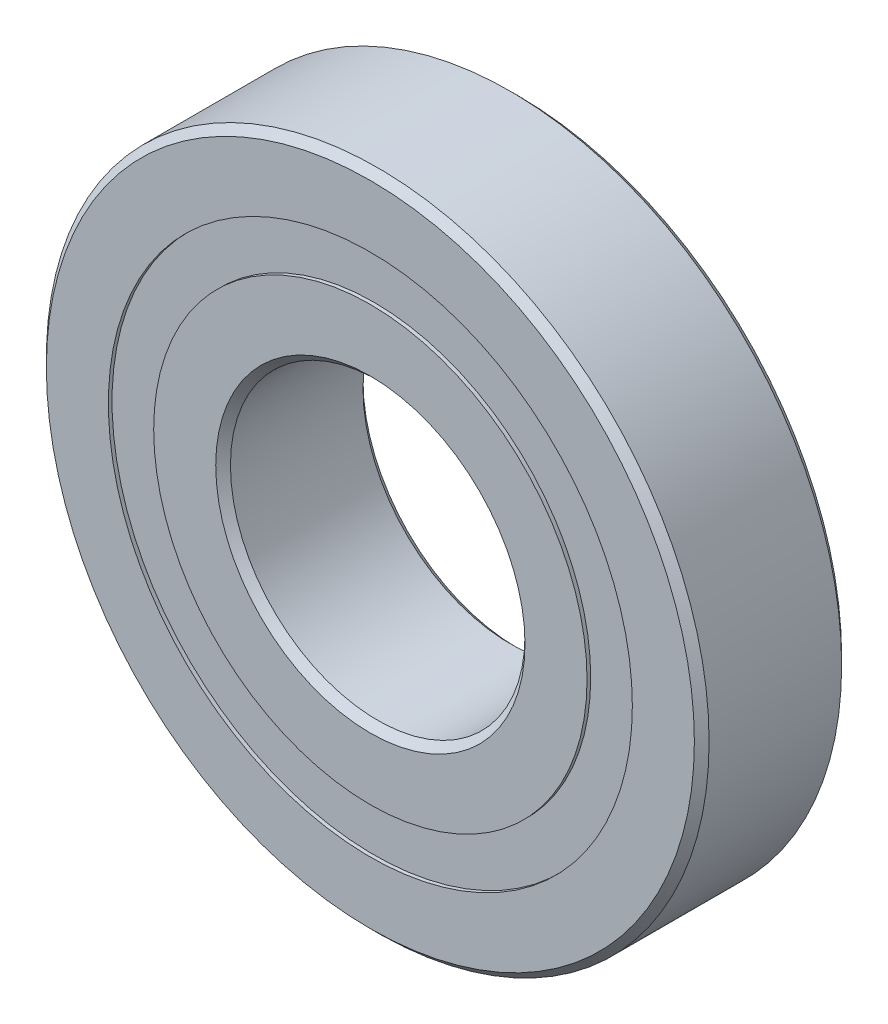
ISO-10303-21;
HEADER;
FILE_DESCRIPTION(('STEP AP214'),'2;1');
FILE_NAME('part.step','',(''),(''),'','','');
FILE_SCHEMA(('AUTOMOTIVE_DESIGN { 1 0 10303 214 1 1 1 1 }'));
ENDSEC;
DATA;
#1=APPLICATION_CONTEXT('core data for automotive mechanical design processes');
#2=APPLICATION_PROTOCOL_DEFINITION('international standard','automotive_design',2000,#1);
#3=PRODUCT_CONTEXT('',#1,'mechanical');
#4=PRODUCT('Part','Part','',(#3));
#5=PRODUCT_RELATED_PRODUCT_CATEGORY('part','',(#4));
#6=PRODUCT_DEFINITION_FORMATION('','',#4);
#7=PRODUCT_DEFINITION_CONTEXT('part definition',#1,'design');
#8=PRODUCT_DEFINITION('design','',#6,#7);
#9=PRODUCT_DEFINITION_SHAPE('','',#8);
#10=(LENGTH_UNIT() NAMED_UNIT(*) SI_UNIT(.MILLI.,.METRE.));
#11=(NAMED_UNIT(*) PLANE_ANGLE_UNIT() SI_UNIT($,.RADIAN.));
#12=(NAMED_UNIT(*) SI_UNIT($,.STERADIAN.) SOLID_ANGLE_UNIT());
#13=UNCERTAINTY_MEASURE_WITH_UNIT(LENGTH_MEASURE(1.E-05),#10,'distance_accuracy_value','');
#14=(GEOMETRIC_REPRESENTATION_CONTEXT(3) GLOBAL_UNCERTAINTY_ASSIGNED_CONTEXT((#13)) GLOBAL_UNIT_ASSIGNED_CONTEXT((#10,
#11,#12)) REPRESENTATION_CONTEXT('',''));
#15=CARTESIAN_POINT('',(0.,0.,0.));
#16=DIRECTION('',(0.,0.,1.));
#17=DIRECTION('',(1.,0.,0.));
#18=AXIS2_PLACEMENT_3D('',#15,#16,#17);
#19=CARTESIAN_POINT('',(0.,11.2956730769231,-3.01625));
#20=DIRECTION('',(0.,0.,1.));
#21=DIRECTION('',(1.,0.,0.));
#22=AXIS2_PLACEMENT_3D('',#19,#20,#21);
#23=PLANE('',#22);
#24=CARTESIAN_POINT('',(0.,0.,-3.01625));
#25=DIRECTION('',(0.,0.,1.));
#26=DIRECTION('',(1.,0.,0.));
#27=AXIS2_PLACEMENT_3D('',#24,#25,#26);
#28=CIRCLE('',#27,11.2956730769231);
#29=CARTESIAN_POINT('',(11.2956730769231,0.,-3.01625));
#30=VERTEX_POINT('',#29);
#31=EDGE_CURVE('E56',#30,#30,#28,.T.);
#32=ORIENTED_EDGE('',*,*,#31,.F.);
#33=EDGE_LOOP('',(#32));
#34=FACE_BOUND('',#33,.T.);
#35=CARTESIAN_POINT('',(0.,0.,-3.01625));
#36=DIRECTION('',(0.,0.,1.));
#37=DIRECTION('',(1.,0.,0.));
#38=AXIS2_PLACEMENT_3D('',#35,#36,#37);
#39=CIRCLE('',#38,9.34182692307692);
#40=CARTESIAN_POINT('',(9.34182692307692,0.,-3.01625));
#41=VERTEX_POINT('',#40);
#42=EDGE_CURVE('E11',#41,#41,#39,.T.);
#43=ORIENTED_EDGE('',*,*,#42,.T.);
#44=EDGE_LOOP('',(#43));
#45=FACE_BOUND('',#44,.T.);
#46=ADVANCED_FACE('F42',(#34,#45),#23,.F.);
#47=CARTESIAN_POINT('',(0.,0.,3.175));
#48=DIRECTION('',(0.,0.,1.));
#49=DIRECTION('',(1.,0.,0.));
#50=AXIS2_PLACEMENT_3D('',#47,#48,#49);
#51=CYLINDRICAL_SURFACE('',#50,9.34182692307692);
#52=ORIENTED_EDGE('',*,*,#42,.F.);
#53=EDGE_LOOP('',(#52));
#54=FACE_BOUND('',#53,.T.);
#55=CARTESIAN_POINT('',(0.,0.,-1.71627890103155));
#56=DIRECTION('',(0.,0.,1.));
#57=DIRECTION('',(1.,0.,0.));
#58=AXIS2_PLACEMENT_3D('',#55,#56,#57);
#59=CIRCLE('',#58,9.34182692307692);
#60=CARTESIAN_POINT('',(9.34182692307692,0.,-1.71627890103155));
#61=VERTEX_POINT('',#60);
#62=EDGE_CURVE('E48',#61,#61,#59,.T.);
#63=ORIENTED_EDGE('',*,*,#62,.T.);
#64=EDGE_LOOP('',(#63));
#65=FACE_BOUND('',#64,.T.);
#66=ADVANCED_FACE('F65',(#54,#65),#51,.F.);
#67=CARTESIAN_POINT('',(0.,11.2956730769231,-1.71627890103155));
#68=DIRECTION('',(0.,0.,-1.));
#69=DIRECTION('',(-1.,0.,0.));
#70=AXIS2_PLACEMENT_3D('',#67,#68,#69);
#71=PLANE('',#70);
#72=ORIENTED_EDGE('',*,*,#62,.F.);
#73=EDGE_LOOP('',(#72));
#74=FACE_BOUND('',#73,.T.);
#75=CARTESIAN_POINT('',(0.,0.,-1.71627890103155));
#76=DIRECTION('',(0.,0.,1.));
#77=DIRECTION('',(1.,0.,0.));
#78=AXIS2_PLACEMENT_3D('',#75,#76,#77);
#79=CIRCLE('',#78,11.2956730769231);
#80=CARTESIAN_POINT('',(11.2956730769231,0.,-1.71627890103155));
#81=VERTEX_POINT('',#80);
#82=EDGE_CURVE('E52',#81,#81,#79,.T.);
#83=ORIENTED_EDGE('',*,*,#82,.T.);
#84=EDGE_LOOP('',(#83));
#85=FACE_BOUND('',#84,.T.);
#86=ADVANCED_FACE('F69',(#74,#85),#71,.F.);
#87=CARTESIAN_POINT('',(0.,0.,3.175));
#88=DIRECTION('',(0.,0.,1.));
#89=DIRECTION('',(1.,0.,0.));
#90=AXIS2_PLACEMENT_3D('',#87,#88,#89);
#91=CYLINDRICAL_SURFACE('',#90,11.2956730769231);
#92=ORIENTED_EDGE('',*,*,#82,.F.);
#93=EDGE_LOOP('',(#92));
#94=FACE_BOUND('',#93,.T.);
#95=ORIENTED_EDGE('',*,*,#31,.T.);
#96=EDGE_LOOP('',(#95));
#97=FACE_BOUND('',#96,.T.);
#98=ADVANCED_FACE('F62',(#94,#97),#91,.T.);
#99=CLOSED_SHELL('',(#46,#66,#86,#98));
#100=MANIFOLD_SOLID_BREP('B2',#99);
#101=CARTESIAN_POINT('',(0.,11.2956730769231,3.01625));
#102=DIRECTION('',(0.,0.,-1.));
#103=DIRECTION('',(-1.,0.,0.));
#104=AXIS2_PLACEMENT_3D('',#101,#102,#103);
#105=PLANE('',#104);
#106=CARTESIAN_POINT('',(0.,0.,3.01625));
#107=DIRECTION('',(0.,0.,1.));
#108=DIRECTION('',(1.,0.,0.));
#109=AXIS2_PLACEMENT_3D('',#106,#107,#108);
#110=CIRCLE('',#109,9.34182692307692);
#111=CARTESIAN_POINT('',(9.34182692307692,0.,3.01625));
#112=VERTEX_POINT('',#111);
#113=EDGE_CURVE('E41',#112,#112,#110,.T.);
#114=ORIENTED_EDGE('',*,*,#113,.F.);
#115=EDGE_LOOP('',(#114));
#116=FACE_BOUND('',#115,.T.);
#117=CARTESIAN_POINT('',(0.,0.,3.01625));
#118=DIRECTION('',(0.,0.,1.));
#119=DIRECTION('',(1.,0.,0.));
#120=AXIS2_PLACEMENT_3D('',#117,#118,#119);
#121=CIRCLE('',#120,11.2956730769231);
#122=CARTESIAN_POINT('',(11.2956730769231,0.,3.01625));
#123=VERTEX_POINT('',#122);
#124=EDGE_CURVE('E124',#123,#123,#121,.T.);
#125=ORIENTED_EDGE('',*,*,#124,.T.);
#126=EDGE_LOOP('',(#125));
#127=FACE_BOUND('',#126,.T.);
#128=ADVANCED_FACE('F110',(#116,#127),#105,.F.);
#129=CARTESIAN_POINT('',(0.,0.,3.175));
#130=DIRECTION('',(0.,0.,1.));
#131=DIRECTION('',(1.,0.,0.));
#132=AXIS2_PLACEMENT_3D('',#129,#130,#131);
#133=CYLINDRICAL_SURFACE('',#132,9.34182692307692);
#134=CARTESIAN_POINT('',(0.,0.,1.71627890103156));
#135=DIRECTION('',(0.,0.,1.));
#136=DIRECTION('',(1.,0.,0.));
#137=AXIS2_PLACEMENT_3D('',#134,#135,#136);
#138=CIRCLE('',#137,9.34182692307692);
#139=CARTESIAN_POINT('',(9.34182692307692,0.,1.71627890103156));
#140=VERTEX_POINT('',#139);
#141=EDGE_CURVE('E116',#140,#140,#138,.T.);
#142=ORIENTED_EDGE('',*,*,#141,.F.);
#143=EDGE_LOOP('',(#142));
#144=FACE_BOUND('',#143,.T.);
#145=ORIENTED_EDGE('',*,*,#113,.T.);
#146=EDGE_LOOP('',(#145));
#147=FACE_BOUND('',#146,.T.);
#148=ADVANCED_FACE('F139',(#144,#147),#133,.F.);
#149=CARTESIAN_POINT('',(0.,11.2956730769231,1.71627890103156));
#150=DIRECTION('',(0.,0.,1.));
#151=DIRECTION('',(1.,0.,0.));
#152=AXIS2_PLACEMENT_3D('',#149,#150,#151);
#153=PLANE('',#152);
#154=CARTESIAN_POINT('',(0.,0.,1.71627890103156));
#155=DIRECTION('',(0.,0.,1.));
#156=DIRECTION('',(1.,0.,0.));
#157=AXIS2_PLACEMENT_3D('',#154,#155,#156);
#158=CIRCLE('',#157,11.2956730769231);
#159=CARTESIAN_POINT('',(11.2956730769231,0.,1.71627890103156));
#160=VERTEX_POINT('',#159);
#161=EDGE_CURVE('E120',#160,#160,#158,.T.);
#162=ORIENTED_EDGE('',*,*,#161,.F.);
#163=EDGE_LOOP('',(#162));
#164=FACE_BOUND('',#163,.T.);
#165=ORIENTED_EDGE('',*,*,#141,.T.);
#166=EDGE_LOOP('',(#165));
#167=FACE_BOUND('',#166,.T.);
#168=ADVANCED_FACE('F134',(#164,#167),#153,.F.);
#169=CARTESIAN_POINT('',(0.,0.,3.175));
#170=DIRECTION('',(0.,0.,1.));
#171=DIRECTION('',(1.,0.,0.));
#172=AXIS2_PLACEMENT_3D('',#169,#170,#171);
#173=CYLINDRICAL_SURFACE('',#172,11.2956730769231);
#174=ORIENTED_EDGE('',*,*,#124,.F.);
#175=EDGE_LOOP('',(#174));
#176=FACE_BOUND('',#175,.T.);
#177=ORIENTED_EDGE('',*,*,#161,.T.);
#178=EDGE_LOOP('',(#177));
#179=FACE_BOUND('',#178,.T.);
#180=ADVANCED_FACE('F131',(#176,#179),#173,.T.);
#181=CLOSED_SHELL('',(#128,#148,#168,#180));
#182=MANIFOLD_SOLID_BREP('B6',#181);
#183=CARTESIAN_POINT('',(-6.06520907209285,8.34804411070657,0.));
#184=DIRECTION('',(0.,0.,1.));
#185=DIRECTION('',(-0.587785252292462,0.809016994374955,0.));
#186=AXIS2_PLACEMENT_3D('',#183,#184,#185);
#187=SPHERICAL_SURFACE('',#186,1.71627890103156);
#188=CARTESIAN_POINT('',(-6.06520907209285,8.34804411070657,1.71627890103156));
#189=VERTEX_POINT('',#188);
#190=VERTEX_LOOP('',#189);
#191=FACE_BOUND('',#190,.T.);
#192=ADVANCED_FACE('F178',(#191),#187,.T.);
#193=CLOSED_SHELL('',(#192));
#194=MANIFOLD_SOLID_BREP('B36',#193);
#195=CARTESIAN_POINT('',(-9.81371442752058,3.1886691107066,0.));
#196=DIRECTION('',(0.,0.,1.));
#197=DIRECTION('',(-0.95105651629515,0.309016994374958,0.));
#198=AXIS2_PLACEMENT_3D('',#195,#196,#197);
#199=SPHERICAL_SURFACE('',#198,1.71627890103156);
#200=CARTESIAN_POINT('',(-9.81371442752058,3.1886691107066,1.71627890103156));
#201=VERTEX_POINT('',#200);
#202=VERTEX_LOOP('',#201);
#203=FACE_BOUND('',#202,.T.);
#204=ADVANCED_FACE('F199',(#203),#199,.T.);
#205=CLOSED_SHELL('',(#204));
#206=MANIFOLD_SOLID_BREP('B106',#205);
#207=CARTESIAN_POINT('',(-9.81371442752065,-3.18866911070639,0.));
#208=DIRECTION('',(0.,0.,1.));
#209=DIRECTION('',(-0.951056516295157,-0.309016994374938,0.));
#210=AXIS2_PLACEMENT_3D('',#207,#208,#209);
#211=SPHERICAL_SURFACE('',#210,1.71627890103156);
#212=CARTESIAN_POINT('',(-9.81371442752065,-3.18866911070639,1.71627890103156));
#213=VERTEX_POINT('',#212);
#214=VERTEX_LOOP('',#213);
#215=FACE_BOUND('',#214,.T.);
#216=ADVANCED_FACE('F220',(#215),#211,.T.);
#217=CLOSED_SHELL('',(#216));
#218=MANIFOLD_SOLID_BREP('B174',#217);
#219=CARTESIAN_POINT('',(-6.06520907209303,-8.34804411070643,0.));
#220=DIRECTION('',(0.,0.,1.));
#221=DIRECTION('',(-0.58778525229248,-0.809016994374942,0.));
#222=AXIS2_PLACEMENT_3D('',#219,#220,#221);
#223=SPHERICAL_SURFACE('',#222,1.71627890103156);
#224=CARTESIAN_POINT('',(-6.06520907209303,-8.34804411070643,1.71627890103156));
#225=VERTEX_POINT('',#224);
#226=VERTEX_LOOP('',#225);
#227=FACE_BOUND('',#226,.T.);
#228=ADVANCED_FACE('F241',(#227),#223,.T.);
#229=CLOSED_SHELL('',(#228));
#230=MANIFOLD_SOLID_BREP('B195',#229);
#231=CARTESIAN_POINT('',(0.,-10.31875,0.));
#232=DIRECTION('',(0.,0.,1.));
#233=DIRECTION('',(0.,-1.,0.));
#234=AXIS2_PLACEMENT_3D('',#231,#232,#233);
#235=SPHERICAL_SURFACE('',#234,1.71627890103156);
#236=CARTESIAN_POINT('',(0.,-10.31875,1.71627890103156));
#237=VERTEX_POINT('',#236);
#238=VERTEX_LOOP('',#237);
#239=FACE_BOUND('',#238,.T.);
#240=ADVANCED_FACE('F262',(#239),#235,.T.);
#241=CLOSED_SHELL('',(#240));
#242=MANIFOLD_SOLID_BREP('B216',#241);
#243=CARTESIAN_POINT('',(6.06520907209291,-8.34804411070652,0.));
#244=DIRECTION('',(0.,0.,1.));
#245=DIRECTION('',(0.587785252292469,-0.809016994374951,0.));
#246=AXIS2_PLACEMENT_3D('',#243,#244,#245);
#247=SPHERICAL_SURFACE('',#246,1.71627890103156);
#248=CARTESIAN_POINT('',(6.06520907209291,-8.34804411070652,1.71627890103156));
#249=VERTEX_POINT('',#248);
#250=VERTEX_LOOP('',#249);
#251=FACE_BOUND('',#250,.T.);
#252=ADVANCED_FACE('F283',(#251),#247,.T.);
#253=CLOSED_SHELL('',(#252));
#254=MANIFOLD_SOLID_BREP('B237',#253);
#255=CARTESIAN_POINT('',(9.8137144275206,-3.18866911070653,0.));
#256=DIRECTION('',(0.,0.,1.));
#257=DIRECTION('',(0.951056516295152,-0.309016994374952,0.));
#258=AXIS2_PLACEMENT_3D('',#255,#256,#257);
#259=SPHERICAL_SURFACE('',#258,1.71627890103156);
#260=CARTESIAN_POINT('',(9.8137144275206,-3.18866911070653,1.71627890103156));
#261=VERTEX_POINT('',#260);
#262=VERTEX_LOOP('',#261);
#263=FACE_BOUND('',#262,.T.);
#264=ADVANCED_FACE('F304',(#263),#259,.T.);
#265=CLOSED_SHELL('',(#264));
#266=MANIFOLD_SOLID_BREP('B258',#265);
#267=CARTESIAN_POINT('',(9.81371442752063,3.18866911070646,0.));
#268=DIRECTION('',(0.,0.,1.));
#269=DIRECTION('',(0.951056516295155,0.309016994374945,0.));
#270=AXIS2_PLACEMENT_3D('',#267,#268,#269);
#271=SPHERICAL_SURFACE('',#270,1.71627890103156);
#272=CARTESIAN_POINT('',(9.81371442752063,3.18866911070646,1.71627890103156));
#273=VERTEX_POINT('',#272);
#274=VERTEX_LOOP('',#273);
#275=FACE_BOUND('',#274,.T.);
#276=ADVANCED_FACE('F325',(#275),#271,.T.);
#277=CLOSED_SHELL('',(#276));
#278=MANIFOLD_SOLID_BREP('B279',#277);
#279=CARTESIAN_POINT('',(6.06520907209297,8.34804411070648,0.));
#280=DIRECTION('',(0.,0.,1.));
#281=DIRECTION('',(0.587785252292474,0.809016994374947,0.));
#282=AXIS2_PLACEMENT_3D('',#279,#280,#281);
#283=SPHERICAL_SURFACE('',#282,1.71627890103156);
#284=CARTESIAN_POINT('',(6.06520907209297,8.34804411070648,1.71627890103156));
#285=VERTEX_POINT('',#284);
#286=VERTEX_LOOP('',#285);
#287=FACE_BOUND('',#286,.T.);
#288=ADVANCED_FACE('F346',(#287),#283,.T.);
#289=CLOSED_SHELL('',(#288));
#290=MANIFOLD_SOLID_BREP('B300',#289);
#291=CARTESIAN_POINT('',(0.,10.31875,0.));
#292=DIRECTION('',(0.,0.,1.));
#293=DIRECTION('',(0.,1.,0.));
#294=AXIS2_PLACEMENT_3D('',#291,#292,#293);
#295=SPHERICAL_SURFACE('',#294,1.71627890103156);
#296=CARTESIAN_POINT('',(0.,10.31875,1.71627890103156));
#297=VERTEX_POINT('',#296);
#298=VERTEX_LOOP('',#297);
#299=FACE_BOUND('',#298,.T.);
#300=ADVANCED_FACE('F369',(#299),#295,.T.);
#301=CLOSED_SHELL('',(#300));
#302=MANIFOLD_SOLID_BREP('B321',#301);
#303=CARTESIAN_POINT('',(0.,9.34182692307692,3.175));
#304=DIRECTION('',(0.,0.,-1.));
#305=DIRECTION('',(-1.,0.,0.));
#306=AXIS2_PLACEMENT_3D('',#303,#304,#305);
#307=PLANE('',#306);
#308=CARTESIAN_POINT('',(0.,0.,3.175));
#309=DIRECTION('',(0.,0.,1.));
#310=DIRECTION('',(1.,0.,0.));
#311=AXIS2_PLACEMENT_3D('',#308,#309,#310);
#312=CIRCLE('',#311,6.6675);
#313=CARTESIAN_POINT('',(6.6675,0.,3.175));
#314=VERTEX_POINT('',#313);
#315=EDGE_CURVE('E417',#314,#314,#312,.T.);
#316=ORIENTED_EDGE('',*,*,#315,.F.);
#317=EDGE_LOOP('',(#316));
#318=FACE_BOUND('',#317,.T.);
#319=CARTESIAN_POINT('',(0.,0.,3.175));
#320=DIRECTION('',(0.,0.,1.));
#321=DIRECTION('',(1.,0.,0.));
#322=AXIS2_PLACEMENT_3D('',#319,#320,#321);
#323=CIRCLE('',#322,9.34182692307692);
#324=CARTESIAN_POINT('',(9.34182692307692,0.,3.175));
#325=VERTEX_POINT('',#324);
#326=EDGE_CURVE('E368',#325,#325,#323,.T.);
#327=ORIENTED_EDGE('',*,*,#326,.T.);
#328=EDGE_LOOP('',(#327));
#329=FACE_BOUND('',#328,.T.);
#330=ADVANCED_FACE('F389',(#318,#329),#307,.F.);
#331=CARTESIAN_POINT('',(0.,0.,3.175));
#332=DIRECTION('',(0.,0.,1.));
#333=DIRECTION('',(1.,0.,0.));
#334=AXIS2_PLACEMENT_3D('',#331,#332,#333);
#335=CYLINDRICAL_SURFACE('',#334,9.34182692307692);
#336=ORIENTED_EDGE('',*,*,#326,.F.);
#337=EDGE_LOOP('',(#336));
#338=FACE_BOUND('',#337,.T.);
#339=CARTESIAN_POINT('',(0.,0.,1.41111111111111));
#340=DIRECTION('',(0.,0.,1.));
#341=DIRECTION('',(1.,0.,0.));
#342=AXIS2_PLACEMENT_3D('',#339,#340,#341);
#343=CIRCLE('',#342,9.34182692307692);
#344=CARTESIAN_POINT('',(9.34182692307692,0.,1.41111111111111));
#345=VERTEX_POINT('',#344);
#346=EDGE_CURVE('E395',#345,#345,#343,.T.);
#347=ORIENTED_EDGE('',*,*,#346,.T.);
#348=EDGE_LOOP('',(#347));
#349=FACE_BOUND('',#348,.T.);
#350=ADVANCED_FACE('F424',(#338,#349),#335,.T.);
#351=CARTESIAN_POINT('',(0.,0.,0.));
#352=DIRECTION('',(0.,0.,1.));
#353=DIRECTION('',(1.,0.,0.));
#354=AXIS2_PLACEMENT_3D('',#351,#352,#353);
#355=TOROIDAL_SURFACE('',#354,10.31875,1.71627890103155);
#356=ORIENTED_EDGE('',*,*,#346,.F.);
#357=EDGE_LOOP('',(#356));
#358=FACE_BOUND('',#357,.T.);
#359=CARTESIAN_POINT('',(0.,0.,-1.41111111111111));
#360=DIRECTION('',(0.,0.,1.));
#361=DIRECTION('',(1.,0.,0.));
#362=AXIS2_PLACEMENT_3D('',#359,#360,#361);
#363=CIRCLE('',#362,9.34182692307692);
#364=CARTESIAN_POINT('',(9.34182692307692,0.,-1.41111111111111));
#365=VERTEX_POINT('',#364);
#366=EDGE_CURVE('E399',#365,#365,#363,.T.);
#367=ORIENTED_EDGE('',*,*,#366,.T.);
#368=EDGE_LOOP('',(#367));
#369=FACE_BOUND('',#368,.T.);
#370=ADVANCED_FACE('F428',(#358,#369),#355,.F.);
#371=CARTESIAN_POINT('',(0.,0.,3.175));
#372=DIRECTION('',(0.,0.,1.));
#373=DIRECTION('',(1.,0.,0.));
#374=AXIS2_PLACEMENT_3D('',#371,#372,#373);
#375=CYLINDRICAL_SURFACE('',#374,9.34182692307692);
#376=ORIENTED_EDGE('',*,*,#366,.F.);
#377=EDGE_LOOP('',(#376));
#378=FACE_BOUND('',#377,.T.);
#379=CARTESIAN_POINT('',(0.,0.,-3.175));
#380=DIRECTION('',(0.,0.,1.));
#381=DIRECTION('',(1.,0.,0.));
#382=AXIS2_PLACEMENT_3D('',#379,#380,#381);
#383=CIRCLE('',#382,9.34182692307692);
#384=CARTESIAN_POINT('',(9.34182692307692,0.,-3.175));
#385=VERTEX_POINT('',#384);
#386=EDGE_CURVE('E403',#385,#385,#383,.T.);
#387=ORIENTED_EDGE('',*,*,#386,.T.);
#388=EDGE_LOOP('',(#387));
#389=FACE_BOUND('',#388,.T.);
#390=ADVANCED_FACE('F433',(#378,#389),#375,.T.);
#391=CARTESIAN_POINT('',(0.,6.6675,-3.175));
#392=DIRECTION('',(0.,0.,1.));
#393=DIRECTION('',(1.,0.,0.));
#394=AXIS2_PLACEMENT_3D('',#391,#392,#393);
#395=PLANE('',#394);
#396=ORIENTED_EDGE('',*,*,#386,.F.);
#397=EDGE_LOOP('',(#396));
#398=FACE_BOUND('',#397,.T.);
#399=CARTESIAN_POINT('',(0.,0.,-3.175));
#400=DIRECTION('',(0.,0.,1.));
#401=DIRECTION('',(1.,0.,0.));
#402=AXIS2_PLACEMENT_3D('',#399,#400,#401);
#403=CIRCLE('',#402,6.6675);
#404=CARTESIAN_POINT('',(6.6675,0.,-3.175));
#405=VERTEX_POINT('',#404);
#406=EDGE_CURVE('E408',#405,#405,#403,.T.);
#407=ORIENTED_EDGE('',*,*,#406,.T.);
#408=EDGE_LOOP('',(#407));
#409=FACE_BOUND('',#408,.T.);
#410=ADVANCED_FACE('F439',(#398,#409),#395,.F.);
#411=CARTESIAN_POINT('',(0.,0.,-2.8575));
#412=DIRECTION('',(0.,0.,-1.));
#413=DIRECTION('',(-1.,0.,0.));
#414=AXIS2_PLACEMENT_3D('',#411,#412,#413);
#415=CONICAL_SURFACE('',#414,6.35,0.785398163397446);
#416=ORIENTED_EDGE('',*,*,#406,.F.);
#417=EDGE_LOOP('',(#416));
#418=FACE_BOUND('',#417,.T.);
#419=CARTESIAN_POINT('',(0.,0.,-2.8575));
#420=DIRECTION('',(0.,0.,1.));
#421=DIRECTION('',(1.,0.,0.));
#422=AXIS2_PLACEMENT_3D('',#419,#420,#421);
#423=CIRCLE('',#422,6.35);
#424=CARTESIAN_POINT('',(6.35,0.,-2.8575));
#425=VERTEX_POINT('',#424);
#426=EDGE_CURVE('E411',#425,#425,#423,.T.);
#427=ORIENTED_EDGE('',*,*,#426,.T.);
#428=EDGE_LOOP('',(#427));
#429=FACE_BOUND('',#428,.T.);
#430=ADVANCED_FACE('F443',(#418,#429),#415,.F.);
#431=CARTESIAN_POINT('',(0.,0.,3.175));
#432=DIRECTION('',(0.,0.,1.));
#433=DIRECTION('',(1.,0.,0.));
#434=AXIS2_PLACEMENT_3D('',#431,#432,#433);
#435=CYLINDRICAL_SURFACE('',#434,6.35);
#436=ORIENTED_EDGE('',*,*,#426,.F.);
#437=EDGE_LOOP('',(#436));
#438=FACE_BOUND('',#437,.T.);
#439=CARTESIAN_POINT('',(0.,0.,2.8575));
#440=DIRECTION('',(0.,0.,1.));
#441=DIRECTION('',(1.,0.,0.));
#442=AXIS2_PLACEMENT_3D('',#439,#440,#441);
#443=CIRCLE('',#442,6.35);
#444=CARTESIAN_POINT('',(6.35,0.,2.8575));
#445=VERTEX_POINT('',#444);
#446=EDGE_CURVE('E414',#445,#445,#443,.T.);
#447=ORIENTED_EDGE('',*,*,#446,.T.);
#448=EDGE_LOOP('',(#447));
#449=FACE_BOUND('',#448,.T.);
#450=ADVANCED_FACE('F447',(#438,#449),#435,.F.);
#451=CARTESIAN_POINT('',(0.,0.,3.175));
#452=DIRECTION('',(0.,0.,1.));
#453=DIRECTION('',(1.,0.,0.));
#454=AXIS2_PLACEMENT_3D('',#451,#452,#453);
#455=CONICAL_SURFACE('',#454,6.6675,0.785398163397452);
#456=ORIENTED_EDGE('',*,*,#446,.F.);
#457=EDGE_LOOP('',(#456));
#458=FACE_BOUND('',#457,.T.);
#459=ORIENTED_EDGE('',*,*,#315,.T.);
#460=EDGE_LOOP('',(#459));
#461=FACE_BOUND('',#460,.T.);
#462=ADVANCED_FACE('F421',(#458,#461),#455,.F.);
#463=CLOSED_SHELL('',(#330,#350,#370,#390,#410,#430,#450,#462));
#464=MANIFOLD_SOLID_BREP('B342',#463);
#465=CARTESIAN_POINT('',(0.,0.,2.8575));
#466=DIRECTION('',(0.,0.,-1.));
#467=DIRECTION('',(-1.,0.,0.));
#468=AXIS2_PLACEMENT_3D('',#465,#466,#467);
#469=CONICAL_SURFACE('',#468,14.2875,0.785398163397446);
#470=CARTESIAN_POINT('',(0.,0.,3.175));
#471=DIRECTION('',(0.,0.,1.));
#472=DIRECTION('',(1.,0.,0.));
#473=AXIS2_PLACEMENT_3D('',#470,#471,#472);
#474=CIRCLE('',#473,13.97);
#475=CARTESIAN_POINT('',(13.97,0.,3.175));
#476=VERTEX_POINT('',#475);
#477=EDGE_CURVE('E539',#476,#476,#474,.T.);
#478=ORIENTED_EDGE('',*,*,#477,.F.);
#479=EDGE_LOOP('',(#478));
#480=FACE_BOUND('',#479,.T.);
#481=CARTESIAN_POINT('',(0.,0.,2.8575));
#482=DIRECTION('',(0.,0.,1.));
#483=DIRECTION('',(1.,0.,0.));
#484=AXIS2_PLACEMENT_3D('',#481,#482,#483);
#485=CIRCLE('',#484,14.2875);
#486=CARTESIAN_POINT('',(14.2875,0.,2.8575));
#487=VERTEX_POINT('',#486);
#488=EDGE_CURVE('E388',#487,#487,#485,.T.);
#489=ORIENTED_EDGE('',*,*,#488,.T.);
#490=EDGE_LOOP('',(#489));
#491=FACE_BOUND('',#490,.T.);
#492=ADVANCED_FACE('F511',(#480,#491),#469,.T.);
#493=CARTESIAN_POINT('',(0.,0.,3.175));
#494=DIRECTION('',(0.,0.,1.));
#495=DIRECTION('',(1.,0.,0.));
#496=AXIS2_PLACEMENT_3D('',#493,#494,#495);
#497=CYLINDRICAL_SURFACE('',#496,14.2875);
#498=ORIENTED_EDGE('',*,*,#488,.F.);
#499=EDGE_LOOP('',(#498));
#500=FACE_BOUND('',#499,.T.);
#501=CARTESIAN_POINT('',(0.,0.,-2.8575));
#502=DIRECTION('',(0.,0.,1.));
#503=DIRECTION('',(1.,0.,0.));
#504=AXIS2_PLACEMENT_3D('',#501,#502,#503);
#505=CIRCLE('',#504,14.2875);
#506=CARTESIAN_POINT('',(14.2875,0.,-2.8575));
#507=VERTEX_POINT('',#506);
#508=EDGE_CURVE('E517',#507,#507,#505,.T.);
#509=ORIENTED_EDGE('',*,*,#508,.T.);
#510=EDGE_LOOP('',(#509));
#511=FACE_BOUND('',#510,.T.);
#512=ADVANCED_FACE('F546',(#500,#511),#497,.T.);
#513=CARTESIAN_POINT('',(0.,0.,-3.175));
#514=DIRECTION('',(0.,0.,1.));
#515=DIRECTION('',(1.,0.,0.));
#516=AXIS2_PLACEMENT_3D('',#513,#514,#515);
#517=CONICAL_SURFACE('',#516,13.97,0.785398163397446);
#518=ORIENTED_EDGE('',*,*,#508,.F.);
#519=EDGE_LOOP('',(#518));
#520=FACE_BOUND('',#519,.T.);
#521=CARTESIAN_POINT('',(0.,0.,-3.175));
#522=DIRECTION('',(0.,0.,1.));
#523=DIRECTION('',(1.,0.,0.));
#524=AXIS2_PLACEMENT_3D('',#521,#522,#523);
#525=CIRCLE('',#524,13.97);
#526=CARTESIAN_POINT('',(13.97,0.,-3.175));
#527=VERTEX_POINT('',#526);
#528=EDGE_CURVE('E521',#527,#527,#525,.T.);
#529=ORIENTED_EDGE('',*,*,#528,.T.);
#530=EDGE_LOOP('',(#529));
#531=FACE_BOUND('',#530,.T.);
#532=ADVANCED_FACE('F550',(#520,#531),#517,.T.);
#533=CARTESIAN_POINT('',(0.,13.97,-3.175));
#534=DIRECTION('',(0.,0.,1.));
#535=DIRECTION('',(1.,0.,0.));
#536=AXIS2_PLACEMENT_3D('',#533,#534,#535);
#537=PLANE('',#536);
#538=ORIENTED_EDGE('',*,*,#528,.F.);
#539=EDGE_LOOP('',(#538));
#540=FACE_BOUND('',#539,.T.);
#541=CARTESIAN_POINT('',(0.,0.,-3.175));
#542=DIRECTION('',(0.,0.,1.));
#543=DIRECTION('',(1.,0.,0.));
#544=AXIS2_PLACEMENT_3D('',#541,#542,#543);
#545=CIRCLE('',#544,11.2956730769231);
#546=CARTESIAN_POINT('',(11.2956730769231,0.,-3.175));
#547=VERTEX_POINT('',#546);
#548=EDGE_CURVE('E525',#547,#547,#545,.T.);
#549=ORIENTED_EDGE('',*,*,#548,.T.);
#550=EDGE_LOOP('',(#549));
#551=FACE_BOUND('',#550,.T.);
#552=ADVANCED_FACE('F555',(#540,#551),#537,.F.);
#553=CARTESIAN_POINT('',(0.,0.,3.175));
#554=DIRECTION('',(0.,0.,1.));
#555=DIRECTION('',(1.,0.,0.));
#556=AXIS2_PLACEMENT_3D('',#553,#554,#555);
#557=CYLINDRICAL_SURFACE('',#556,11.2956730769231);
#558=ORIENTED_EDGE('',*,*,#548,.F.);
#559=EDGE_LOOP('',(#558));
#560=FACE_BOUND('',#559,.T.);
#561=CARTESIAN_POINT('',(0.,0.,-1.41111111111111));
#562=DIRECTION('',(0.,0.,1.));
#563=DIRECTION('',(1.,0.,0.));
#564=AXIS2_PLACEMENT_3D('',#561,#562,#563);
#565=CIRCLE('',#564,11.2956730769231);
#566=CARTESIAN_POINT('',(11.2956730769231,0.,-1.41111111111111));
#567=VERTEX_POINT('',#566);
#568=EDGE_CURVE('E530',#567,#567,#565,.T.);
#569=ORIENTED_EDGE('',*,*,#568,.T.);
#570=EDGE_LOOP('',(#569));
#571=FACE_BOUND('',#570,.T.);
#572=ADVANCED_FACE('F561',(#560,#571),#557,.F.);
#573=CARTESIAN_POINT('',(0.,0.,0.));
#574=DIRECTION('',(0.,0.,1.));
#575=DIRECTION('',(1.,0.,0.));
#576=AXIS2_PLACEMENT_3D('',#573,#574,#575);
#577=TOROIDAL_SURFACE('',#576,10.31875,1.71627890103156);
#578=ORIENTED_EDGE('',*,*,#568,.F.);
#579=EDGE_LOOP('',(#578));
#580=FACE_BOUND('',#579,.T.);
#581=CARTESIAN_POINT('',(0.,0.,1.41111111111111));
#582=DIRECTION('',(0.,0.,1.));
#583=DIRECTION('',(1.,0.,0.));
#584=AXIS2_PLACEMENT_3D('',#581,#582,#583);
#585=CIRCLE('',#584,11.2956730769231);
#586=CARTESIAN_POINT('',(11.2956730769231,0.,1.41111111111111));
#587=VERTEX_POINT('',#586);
#588=EDGE_CURVE('E533',#587,#587,#585,.T.);
#589=ORIENTED_EDGE('',*,*,#588,.T.);
#590=EDGE_LOOP('',(#589));
#591=FACE_BOUND('',#590,.T.);
#592=ADVANCED_FACE('F565',(#580,#591),#577,.F.);
#593=CARTESIAN_POINT('',(0.,0.,3.175));
#594=DIRECTION('',(0.,0.,1.));
#595=DIRECTION('',(1.,0.,0.));
#596=AXIS2_PLACEMENT_3D('',#593,#594,#595);
#597=CYLINDRICAL_SURFACE('',#596,11.2956730769231);
#598=ORIENTED_EDGE('',*,*,#588,.F.);
#599=EDGE_LOOP('',(#598));
#600=FACE_BOUND('',#599,.T.);
#601=CARTESIAN_POINT('',(0.,0.,3.175));
#602=DIRECTION('',(0.,0.,1.));
#603=DIRECTION('',(1.,0.,0.));
#604=AXIS2_PLACEMENT_3D('',#601,#602,#603);
#605=CIRCLE('',#604,11.2956730769231);
#606=CARTESIAN_POINT('',(11.2956730769231,0.,3.175));
#607=VERTEX_POINT('',#606);
#608=EDGE_CURVE('E536',#607,#607,#605,.T.);
#609=ORIENTED_EDGE('',*,*,#608,.T.);
#610=EDGE_LOOP('',(#609));
#611=FACE_BOUND('',#610,.T.);
#612=ADVANCED_FACE('F569',(#600,#611),#597,.F.);
#613=CARTESIAN_POINT('',(0.,13.97,3.175));
#614=DIRECTION('',(0.,0.,-1.));
#615=DIRECTION('',(-1.,0.,0.));
#616=AXIS2_PLACEMENT_3D('',#613,#614,#615);
#617=PLANE('',#616);
#618=ORIENTED_EDGE('',*,*,#608,.F.);
#619=EDGE_LOOP('',(#618));
#620=FACE_BOUND('',#619,.T.);
#621=ORIENTED_EDGE('',*,*,#477,.T.);
#622=EDGE_LOOP('',(#621));
#623=FACE_BOUND('',#622,.T.);
#624=ADVANCED_FACE('F543',(#620,#623),#617,.F.);
#625=CLOSED_SHELL('',(#492,#512,#532,#552,#572,#592,#612,#624));
#626=MANIFOLD_SOLID_BREP('B363',#625);
#627=ADVANCED_BREP_SHAPE_REPRESENTATION('',(#18,#100,#182,#194,#206,#218,#230,#242,#254,#266,
#278,#290,#302,#464,#626),#14);
#628=SHAPE_DEFINITION_REPRESENTATION(#9,#627);
ENDSEC;
END-ISO-10303-21;
